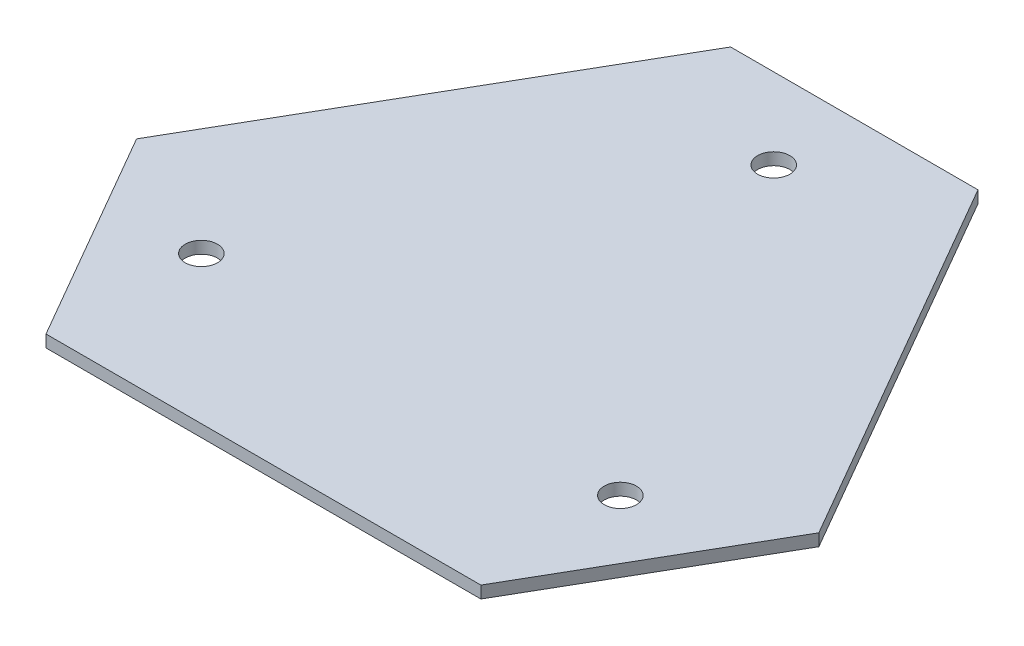
ISO-10303-21;
HEADER;
FILE_DESCRIPTION(('STEP AP214'),'2;1');
FILE_NAME('part.step','',(''),(''),'','','');
FILE_SCHEMA(('AUTOMOTIVE_DESIGN { 1 0 10303 214 1 1 1 1 }'));
ENDSEC;
DATA;
#1=APPLICATION_CONTEXT('core data for automotive mechanical design processes');
#2=APPLICATION_PROTOCOL_DEFINITION('international standard','automotive_design',2000,#1);
#3=PRODUCT_CONTEXT('',#1,'mechanical');
#4=PRODUCT('Part','Part','',(#3));
#5=PRODUCT_RELATED_PRODUCT_CATEGORY('part','',(#4));
#6=PRODUCT_DEFINITION_FORMATION('','',#4);
#7=PRODUCT_DEFINITION_CONTEXT('part definition',#1,'design');
#8=PRODUCT_DEFINITION('design','',#6,#7);
#9=PRODUCT_DEFINITION_SHAPE('','',#8);
#10=(LENGTH_UNIT() NAMED_UNIT(*) SI_UNIT(.MILLI.,.METRE.));
#11=(NAMED_UNIT(*) PLANE_ANGLE_UNIT() SI_UNIT($,.RADIAN.));
#12=(NAMED_UNIT(*) SI_UNIT($,.STERADIAN.) SOLID_ANGLE_UNIT());
#13=UNCERTAINTY_MEASURE_WITH_UNIT(LENGTH_MEASURE(1.E-05),#10,'distance_accuracy_value','');
#14=(GEOMETRIC_REPRESENTATION_CONTEXT(3) GLOBAL_UNCERTAINTY_ASSIGNED_CONTEXT((#13)) GLOBAL_UNIT_ASSIGNED_CONTEXT((#10,
#11,#12)) REPRESENTATION_CONTEXT('',''));
#15=CARTESIAN_POINT('',(0.,0.,0.));
#16=DIRECTION('',(0.,0.,1.));
#17=DIRECTION('',(1.,0.,0.));
#18=AXIS2_PLACEMENT_3D('',#15,#16,#17);
#19=CARTESIAN_POINT('',(-28.8213807428147,121.5,-16.6400319302808));
#20=DIRECTION('',(-0.866025403784439,0.,-0.5));
#21=DIRECTION('',(-0.5,0.,0.866025403784439));
#22=AXIS2_PLACEMENT_3D('',#19,#20,#21);
#23=PLANE('',#22);
#24=DIRECTION('',(0.5,0.,-0.866025403784439));
#25=VECTOR('',#24,1.);
#26=CARTESIAN_POINT('',(-28.8213807428147,120.,-16.6400319302808));
#27=LINE('',#26,#25);
#28=CARTESIAN_POINT('',(-42.3030155234739,120.,6.71084447890853));
#29=VERTEX_POINT('',#28);
#30=CARTESIAN_POINT('',(-15.3397459621556,120.,-39.9909083394701));
#31=VERTEX_POINT('',#30);
#32=EDGE_CURVE('E131',#29,#31,#27,.T.);
#33=ORIENTED_EDGE('',*,*,#32,.F.);
#34=DIRECTION('',(0.,-1.,0.));
#35=VECTOR('',#34,1.);
#36=CARTESIAN_POINT('',(-42.3030155234739,121.5,6.71084447890853));
#37=LINE('',#36,#35);
#38=CARTESIAN_POINT('',(-42.3030155234739,121.5,6.71084447890853));
#39=VERTEX_POINT('',#38);
#40=EDGE_CURVE('E11',#39,#29,#37,.T.);
#41=ORIENTED_EDGE('',*,*,#40,.F.);
#42=DIRECTION('',(0.5,0.,-0.866025403784439));
#43=VECTOR('',#42,1.);
#44=CARTESIAN_POINT('',(-28.8213807428147,121.5,-16.6400319302808));
#45=LINE('',#44,#43);
#46=CARTESIAN_POINT('',(-15.3397459621556,121.5,-39.9909083394701));
#47=VERTEX_POINT('',#46);
#48=EDGE_CURVE('E266',#39,#47,#45,.T.);
#49=ORIENTED_EDGE('',*,*,#48,.T.);
#50=DIRECTION('',(0.,-1.,0.));
#51=VECTOR('',#50,1.);
#52=CARTESIAN_POINT('',(-15.3397459621556,121.5,-39.9909083394701));
#53=LINE('',#52,#51);
#54=EDGE_CURVE('E57',#47,#31,#53,.T.);
#55=ORIENTED_EDGE('',*,*,#54,.T.);
#56=EDGE_LOOP('',(#33,#41,#49,#55));
#57=FACE_BOUND('',#56,.T.);
#58=ADVANCED_FACE('F40',(#57),#23,.T.);
#59=CARTESIAN_POINT('',(-34.6331425423961,121.5,19.995454169735));
#60=DIRECTION('',(-0.866025403784439,0.,0.5));
#61=DIRECTION('',(0.5,0.,0.866025403784439));
#62=AXIS2_PLACEMENT_3D('',#59,#60,#61);
#63=PLANE('',#62);
#64=DIRECTION('',(-0.5,0.,-0.866025403784439));
#65=VECTOR('',#64,1.);
#66=CARTESIAN_POINT('',(-34.6331425423961,120.,19.995454169735));
#67=LINE('',#66,#65);
#68=CARTESIAN_POINT('',(-26.9632695613183,120.,33.2800638605616));
#69=VERTEX_POINT('',#68);
#70=EDGE_CURVE('E133',#69,#29,#67,.T.);
#71=ORIENTED_EDGE('',*,*,#70,.F.);
#72=DIRECTION('',(0.,-1.,0.));
#73=VECTOR('',#72,1.);
#74=CARTESIAN_POINT('',(-26.9632695613183,121.5,33.2800638605616));
#75=LINE('',#74,#73);
#76=CARTESIAN_POINT('',(-26.9632695613183,121.5,33.2800638605616));
#77=VERTEX_POINT('',#76);
#78=EDGE_CURVE('E49',#77,#69,#75,.T.);
#79=ORIENTED_EDGE('',*,*,#78,.F.);
#80=DIRECTION('',(-0.5,0.,-0.866025403784439));
#81=VECTOR('',#80,1.);
#82=CARTESIAN_POINT('',(-34.6331425423961,121.5,19.995454169735));
#83=LINE('',#82,#81);
#84=EDGE_CURVE('E272',#77,#39,#83,.T.);
#85=ORIENTED_EDGE('',*,*,#84,.T.);
#86=ORIENTED_EDGE('',*,*,#40,.T.);
#87=EDGE_LOOP('',(#71,#79,#85,#86));
#88=FACE_BOUND('',#87,.T.);
#89=ADVANCED_FACE('F154',(#88),#63,.T.);
#90=CARTESIAN_POINT('',(0.,121.5,33.2800638605616));
#91=DIRECTION('',(0.,0.,1.));
#92=DIRECTION('',(1.,0.,0.));
#93=AXIS2_PLACEMENT_3D('',#90,#91,#92);
#94=PLANE('',#93);
#95=DIRECTION('',(-1.,0.,0.));
#96=VECTOR('',#95,1.);
#97=CARTESIAN_POINT('',(0.,120.,33.2800638605616));
#98=LINE('',#97,#96);
#99=CARTESIAN_POINT('',(26.9632695613183,120.,33.2800638605616));
#100=VERTEX_POINT('',#99);
#101=EDGE_CURVE('E136',#100,#69,#98,.T.);
#102=ORIENTED_EDGE('',*,*,#101,.F.);
#103=DIRECTION('',(0.,-1.,0.));
#104=VECTOR('',#103,1.);
#105=CARTESIAN_POINT('',(26.9632695613183,121.5,33.2800638605616));
#106=LINE('',#105,#104);
#107=CARTESIAN_POINT('',(26.9632695613183,121.5,33.2800638605616));
#108=VERTEX_POINT('',#107);
#109=EDGE_CURVE('E104',#108,#100,#106,.T.);
#110=ORIENTED_EDGE('',*,*,#109,.F.);
#111=DIRECTION('',(-1.,0.,0.));
#112=VECTOR('',#111,1.);
#113=CARTESIAN_POINT('',(0.,121.5,33.2800638605616));
#114=LINE('',#113,#112);
#115=EDGE_CURVE('E114',#108,#77,#114,.T.);
#116=ORIENTED_EDGE('',*,*,#115,.T.);
#117=ORIENTED_EDGE('',*,*,#78,.T.);
#118=EDGE_LOOP('',(#102,#110,#116,#117));
#119=FACE_BOUND('',#118,.T.);
#120=ADVANCED_FACE('F151',(#119),#94,.T.);
#121=CARTESIAN_POINT('',(34.6331425423961,121.5,19.995454169735));
#122=DIRECTION('',(0.866025403784439,0.,0.5));
#123=DIRECTION('',(0.5,0.,-0.866025403784439));
#124=AXIS2_PLACEMENT_3D('',#121,#122,#123);
#125=PLANE('',#124);
#126=DIRECTION('',(-0.5,0.,0.866025403784439));
#127=VECTOR('',#126,1.);
#128=CARTESIAN_POINT('',(34.6331425423961,120.,19.995454169735));
#129=LINE('',#128,#127);
#130=CARTESIAN_POINT('',(42.3030155234739,120.,6.71084447890852));
#131=VERTEX_POINT('',#130);
#132=EDGE_CURVE('E100',#131,#100,#129,.T.);
#133=ORIENTED_EDGE('',*,*,#132,.F.);
#134=DIRECTION('',(0.,-1.,0.));
#135=VECTOR('',#134,1.);
#136=CARTESIAN_POINT('',(42.3030155234739,121.5,6.71084447890852));
#137=LINE('',#136,#135);
#138=CARTESIAN_POINT('',(42.3030155234739,121.5,6.71084447890852));
#139=VERTEX_POINT('',#138);
#140=EDGE_CURVE('E95',#139,#131,#137,.T.);
#141=ORIENTED_EDGE('',*,*,#140,.F.);
#142=DIRECTION('',(-0.5,0.,0.866025403784439));
#143=VECTOR('',#142,1.);
#144=CARTESIAN_POINT('',(34.6331425423961,121.5,19.995454169735));
#145=LINE('',#144,#143);
#146=EDGE_CURVE('E98',#139,#108,#145,.T.);
#147=ORIENTED_EDGE('',*,*,#146,.T.);
#148=ORIENTED_EDGE('',*,*,#109,.T.);
#149=EDGE_LOOP('',(#133,#141,#147,#148));
#150=FACE_BOUND('',#149,.T.);
#151=ADVANCED_FACE('F97',(#150),#125,.T.);
#152=CARTESIAN_POINT('',(28.8213807428147,121.5,-16.6400319302808));
#153=DIRECTION('',(0.866025403784438,0.,-0.5));
#154=DIRECTION('',(-0.5,0.,-0.866025403784439));
#155=AXIS2_PLACEMENT_3D('',#152,#153,#154);
#156=PLANE('',#155);
#157=DIRECTION('',(0.5,0.,0.866025403784439));
#158=VECTOR('',#157,1.);
#159=CARTESIAN_POINT('',(28.8213807428147,120.,-16.6400319302808));
#160=LINE('',#159,#158);
#161=CARTESIAN_POINT('',(15.3397459621556,120.,-39.9909083394701));
#162=VERTEX_POINT('',#161);
#163=EDGE_CURVE('E140',#162,#131,#160,.T.);
#164=ORIENTED_EDGE('',*,*,#163,.F.);
#165=DIRECTION('',(0.,-1.,0.));
#166=VECTOR('',#165,1.);
#167=CARTESIAN_POINT('',(15.3397459621556,121.5,-39.9909083394701));
#168=LINE('',#167,#166);
#169=CARTESIAN_POINT('',(15.3397459621556,121.5,-39.9909083394701));
#170=VERTEX_POINT('',#169);
#171=EDGE_CURVE('E76',#170,#162,#168,.T.);
#172=ORIENTED_EDGE('',*,*,#171,.F.);
#173=DIRECTION('',(0.5,0.,0.866025403784439));
#174=VECTOR('',#173,1.);
#175=CARTESIAN_POINT('',(28.8213807428147,121.5,-16.6400319302808));
#176=LINE('',#175,#174);
#177=EDGE_CURVE('E111',#170,#139,#176,.T.);
#178=ORIENTED_EDGE('',*,*,#177,.T.);
#179=ORIENTED_EDGE('',*,*,#140,.T.);
#180=EDGE_LOOP('',(#164,#172,#178,#179));
#181=FACE_BOUND('',#180,.T.);
#182=ADVANCED_FACE('F116',(#181),#156,.T.);
#183=CARTESIAN_POINT('',(0.,121.5,-30.));
#184=DIRECTION('',(0.,-1.,0.));
#185=DIRECTION('',(0.,0.,-1.));
#186=AXIS2_PLACEMENT_3D('',#183,#184,#185);
#187=CYLINDRICAL_SURFACE('',#186,2.);
#188=CARTESIAN_POINT('',(0.,121.5,-30.));
#189=DIRECTION('',(0.,1.,0.));
#190=DIRECTION('',(0.,0.,1.));
#191=AXIS2_PLACEMENT_3D('',#188,#189,#190);
#192=CIRCLE('',#191,2.);
#193=CARTESIAN_POINT('',(0.,121.5,-28.));
#194=VERTEX_POINT('',#193);
#195=EDGE_CURVE('E263',#194,#194,#192,.T.);
#196=ORIENTED_EDGE('',*,*,#195,.T.);
#197=EDGE_LOOP('',(#196));
#198=FACE_BOUND('',#197,.T.);
#199=CARTESIAN_POINT('',(0.,120.,-30.));
#200=DIRECTION('',(0.,1.,0.));
#201=DIRECTION('',(0.,0.,1.));
#202=AXIS2_PLACEMENT_3D('',#199,#200,#201);
#203=CIRCLE('',#202,2.);
#204=CARTESIAN_POINT('',(0.,120.,-28.));
#205=VERTEX_POINT('',#204);
#206=EDGE_CURVE('E128',#205,#205,#203,.T.);
#207=ORIENTED_EDGE('',*,*,#206,.F.);
#208=EDGE_LOOP('',(#207));
#209=FACE_BOUND('',#208,.T.);
#210=ADVANCED_FACE('F180',(#198,#209),#187,.F.);
#211=CARTESIAN_POINT('',(25.9807621135331,121.5,15.0000000000001));
#212=DIRECTION('',(0.,-1.,0.));
#213=DIRECTION('',(0.,0.,-1.));
#214=AXIS2_PLACEMENT_3D('',#211,#212,#213);
#215=CYLINDRICAL_SURFACE('',#214,2.);
#216=CARTESIAN_POINT('',(25.9807621135331,121.5,15.0000000000001));
#217=DIRECTION('',(0.,1.,0.));
#218=DIRECTION('',(0.,0.,1.));
#219=AXIS2_PLACEMENT_3D('',#216,#217,#218);
#220=CIRCLE('',#219,2.);
#221=CARTESIAN_POINT('',(25.9807621135331,121.5,17.0000000000001));
#222=VERTEX_POINT('',#221);
#223=EDGE_CURVE('E191',#222,#222,#220,.T.);
#224=ORIENTED_EDGE('',*,*,#223,.T.);
#225=EDGE_LOOP('',(#224));
#226=FACE_BOUND('',#225,.T.);
#227=CARTESIAN_POINT('',(25.9807621135331,120.,15.0000000000001));
#228=DIRECTION('',(0.,1.,0.));
#229=DIRECTION('',(0.,0.,1.));
#230=AXIS2_PLACEMENT_3D('',#227,#228,#229);
#231=CIRCLE('',#230,2.);
#232=CARTESIAN_POINT('',(25.9807621135331,120.,17.0000000000001));
#233=VERTEX_POINT('',#232);
#234=EDGE_CURVE('E125',#233,#233,#231,.T.);
#235=ORIENTED_EDGE('',*,*,#234,.F.);
#236=EDGE_LOOP('',(#235));
#237=FACE_BOUND('',#236,.T.);
#238=ADVANCED_FACE('F167',(#226,#237),#215,.F.);
#239=CARTESIAN_POINT('',(-25.9807621135333,121.5,14.9999999999998));
#240=DIRECTION('',(0.,-1.,0.));
#241=DIRECTION('',(0.,0.,-1.));
#242=AXIS2_PLACEMENT_3D('',#239,#240,#241);
#243=CYLINDRICAL_SURFACE('',#242,2.);
#244=CARTESIAN_POINT('',(-25.9807621135333,121.5,14.9999999999998));
#245=DIRECTION('',(0.,1.,0.));
#246=DIRECTION('',(0.,0.,1.));
#247=AXIS2_PLACEMENT_3D('',#244,#245,#246);
#248=CIRCLE('',#247,2.);
#249=CARTESIAN_POINT('',(-25.9807621135333,121.5,16.9999999999998));
#250=VERTEX_POINT('',#249);
#251=EDGE_CURVE('E145',#250,#250,#248,.T.);
#252=ORIENTED_EDGE('',*,*,#251,.T.);
#253=EDGE_LOOP('',(#252));
#254=FACE_BOUND('',#253,.T.);
#255=CARTESIAN_POINT('',(-25.9807621135333,120.,14.9999999999998));
#256=DIRECTION('',(0.,1.,0.));
#257=DIRECTION('',(0.,0.,1.));
#258=AXIS2_PLACEMENT_3D('',#255,#256,#257);
#259=CIRCLE('',#258,2.);
#260=CARTESIAN_POINT('',(-25.9807621135333,120.,16.9999999999998));
#261=VERTEX_POINT('',#260);
#262=EDGE_CURVE('E122',#261,#261,#259,.T.);
#263=ORIENTED_EDGE('',*,*,#262,.F.);
#264=EDGE_LOOP('',(#263));
#265=FACE_BOUND('',#264,.T.);
#266=ADVANCED_FACE('F42',(#254,#265),#243,.F.);
#267=CARTESIAN_POINT('',(0.,121.5,-39.9909083394701));
#268=DIRECTION('',(0.,0.,-1.));
#269=DIRECTION('',(-1.,0.,0.));
#270=AXIS2_PLACEMENT_3D('',#267,#268,#269);
#271=PLANE('',#270);
#272=DIRECTION('',(1.,0.,0.));
#273=VECTOR('',#272,1.);
#274=CARTESIAN_POINT('',(0.,120.,-39.9909083394701));
#275=LINE('',#274,#273);
#276=EDGE_CURVE('E142',#31,#162,#275,.T.);
#277=ORIENTED_EDGE('',*,*,#276,.F.);
#278=ORIENTED_EDGE('',*,*,#54,.F.);
#279=DIRECTION('',(1.,0.,0.));
#280=VECTOR('',#279,1.);
#281=CARTESIAN_POINT('',(0.,121.5,-39.9909083394701));
#282=LINE('',#281,#280);
#283=EDGE_CURVE('E117',#47,#170,#282,.T.);
#284=ORIENTED_EDGE('',*,*,#283,.T.);
#285=ORIENTED_EDGE('',*,*,#171,.T.);
#286=EDGE_LOOP('',(#277,#278,#284,#285));
#287=FACE_BOUND('',#286,.T.);
#288=ADVANCED_FACE('F157',(#287),#271,.T.);
#289=CARTESIAN_POINT('',(0.,121.5,0.));
#290=DIRECTION('',(0.,1.,0.));
#291=DIRECTION('',(0.,0.,1.));
#292=AXIS2_PLACEMENT_3D('',#289,#290,#291);
#293=PLANE('',#292);
#294=ORIENTED_EDGE('',*,*,#251,.F.);
#295=EDGE_LOOP('',(#294));
#296=FACE_BOUND('',#295,.T.);
#297=ORIENTED_EDGE('',*,*,#223,.F.);
#298=EDGE_LOOP('',(#297));
#299=FACE_BOUND('',#298,.T.);
#300=ORIENTED_EDGE('',*,*,#195,.F.);
#301=EDGE_LOOP('',(#300));
#302=FACE_BOUND('',#301,.T.);
#303=ORIENTED_EDGE('',*,*,#48,.F.);
#304=ORIENTED_EDGE('',*,*,#84,.F.);
#305=ORIENTED_EDGE('',*,*,#115,.F.);
#306=ORIENTED_EDGE('',*,*,#146,.F.);
#307=ORIENTED_EDGE('',*,*,#177,.F.);
#308=ORIENTED_EDGE('',*,*,#283,.F.);
#309=EDGE_LOOP('',(#303,#304,#305,#306,#307,#308));
#310=FACE_BOUND('',#309,.T.);
#311=ADVANCED_FACE('F109',(#296,#299,#302,#310),#293,.T.);
#312=CARTESIAN_POINT('',(0.,120.,0.));
#313=DIRECTION('',(0.,1.,0.));
#314=DIRECTION('',(0.,0.,1.));
#315=AXIS2_PLACEMENT_3D('',#312,#313,#314);
#316=PLANE('',#315);
#317=ORIENTED_EDGE('',*,*,#262,.T.);
#318=EDGE_LOOP('',(#317));
#319=FACE_BOUND('',#318,.T.);
#320=ORIENTED_EDGE('',*,*,#234,.T.);
#321=EDGE_LOOP('',(#320));
#322=FACE_BOUND('',#321,.T.);
#323=ORIENTED_EDGE('',*,*,#206,.T.);
#324=EDGE_LOOP('',(#323));
#325=FACE_BOUND('',#324,.T.);
#326=ORIENTED_EDGE('',*,*,#32,.T.);
#327=ORIENTED_EDGE('',*,*,#276,.T.);
#328=ORIENTED_EDGE('',*,*,#163,.T.);
#329=ORIENTED_EDGE('',*,*,#132,.T.);
#330=ORIENTED_EDGE('',*,*,#101,.T.);
#331=ORIENTED_EDGE('',*,*,#70,.T.);
#332=EDGE_LOOP('',(#326,#327,#328,#329,#330,#331));
#333=FACE_BOUND('',#332,.T.);
#334=ADVANCED_FACE('F156',(#319,#322,#325,#333),#316,.F.);
#335=CLOSED_SHELL('',(#58,#89,#120,#151,#182,#210,#238,#266,#288,#311,#334));
#336=MANIFOLD_SOLID_BREP('B2',#335);
#337=ADVANCED_BREP_SHAPE_REPRESENTATION('',(#18,#336),#14);
#338=SHAPE_DEFINITION_REPRESENTATION(#9,#337);
ENDSEC;
END-ISO-10303-21;
